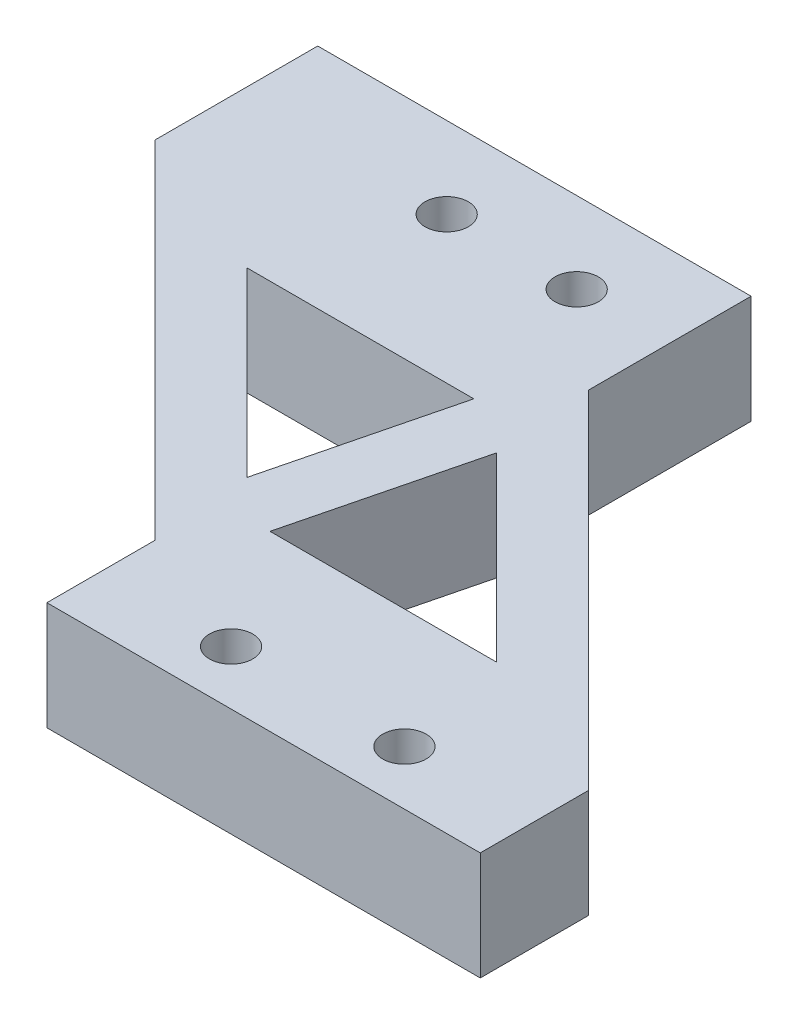
ISO-10303-21;
HEADER;
FILE_DESCRIPTION(('STEP AP214'),'2;1');
FILE_NAME('part.step','',(''),(''),'','','');
FILE_SCHEMA(('AUTOMOTIVE_DESIGN { 1 0 10303 214 1 1 1 1 }'));
ENDSEC;
DATA;
#1=APPLICATION_CONTEXT('core data for automotive mechanical design processes');
#2=APPLICATION_PROTOCOL_DEFINITION('international standard','automotive_design',2000,#1);
#3=PRODUCT_CONTEXT('',#1,'mechanical');
#4=PRODUCT('Part','Part','',(#3));
#5=PRODUCT_RELATED_PRODUCT_CATEGORY('part','',(#4));
#6=PRODUCT_DEFINITION_FORMATION('','',#4);
#7=PRODUCT_DEFINITION_CONTEXT('part definition',#1,'design');
#8=PRODUCT_DEFINITION('design','',#6,#7);
#9=PRODUCT_DEFINITION_SHAPE('','',#8);
#10=(LENGTH_UNIT() NAMED_UNIT(*) SI_UNIT(.MILLI.,.METRE.));
#11=(NAMED_UNIT(*) PLANE_ANGLE_UNIT() SI_UNIT($,.RADIAN.));
#12=(NAMED_UNIT(*) SI_UNIT($,.STERADIAN.) SOLID_ANGLE_UNIT());
#13=UNCERTAINTY_MEASURE_WITH_UNIT(LENGTH_MEASURE(1.E-05),#10,'distance_accuracy_value','');
#14=(GEOMETRIC_REPRESENTATION_CONTEXT(3) GLOBAL_UNCERTAINTY_ASSIGNED_CONTEXT((#13)) GLOBAL_UNIT_ASSIGNED_CONTEXT((#10,
#11,#12)) REPRESENTATION_CONTEXT('',''));
#15=CARTESIAN_POINT('',(0.,0.,0.));
#16=DIRECTION('',(0.,0.,1.));
#17=DIRECTION('',(1.,0.,0.));
#18=AXIS2_PLACEMENT_3D('',#15,#16,#17);
#19=CARTESIAN_POINT('',(-37.1727452841395,5.,-27.4746050582321));
#20=DIRECTION('',(0.707106781186549,0.,-0.707106781186546));
#21=DIRECTION('',(-0.707106781186546,0.,-0.707106781186549));
#22=AXIS2_PLACEMENT_3D('',#19,#20,#21);
#23=PLANE('',#22);
#24=DIRECTION('',(0.707106781186546,0.,0.707106781186549));
#25=VECTOR('',#24,1.);
#26=CARTESIAN_POINT('',(-37.1727452841395,0.,-27.4746050582321));
#27=LINE('',#26,#25);
#28=CARTESIAN_POINT('',(-37.1727452841395,0.,-27.4746050582321));
#29=VERTEX_POINT('',#28);
#30=CARTESIAN_POINT('',(-21.1727452841395,0.,-11.4746050582321));
#31=VERTEX_POINT('',#30);
#32=EDGE_CURVE('E226',#29,#31,#27,.T.);
#33=ORIENTED_EDGE('',*,*,#32,.T.);
#34=DIRECTION('',(0.,-1.,0.));
#35=VECTOR('',#34,1.);
#36=CARTESIAN_POINT('',(-21.1727452841395,5.,-11.4746050582321));
#37=LINE('',#36,#35);
#38=CARTESIAN_POINT('',(-21.1727452841395,5.,-11.4746050582321));
#39=VERTEX_POINT('',#38);
#40=EDGE_CURVE('E11',#39,#31,#37,.T.);
#41=ORIENTED_EDGE('',*,*,#40,.F.);
#42=DIRECTION('',(0.707106781186546,0.,0.707106781186549));
#43=VECTOR('',#42,1.);
#44=CARTESIAN_POINT('',(-37.1727452841395,5.,-27.4746050582321));
#45=LINE('',#44,#43);
#46=CARTESIAN_POINT('',(-37.1727452841395,5.,-27.4746050582321));
#47=VERTEX_POINT('',#46);
#48=EDGE_CURVE('E227',#47,#39,#45,.T.);
#49=ORIENTED_EDGE('',*,*,#48,.F.);
#50=DIRECTION('',(0.,-1.,0.));
#51=VECTOR('',#50,1.);
#52=CARTESIAN_POINT('',(-37.1727452841395,5.,-27.4746050582321));
#53=LINE('',#52,#51);
#54=EDGE_CURVE('E232',#47,#29,#53,.T.);
#55=ORIENTED_EDGE('',*,*,#54,.T.);
#56=EDGE_LOOP('',(#33,#41,#49,#55));
#57=FACE_BOUND('',#56,.T.);
#58=ADVANCED_FACE('F32',(#57),#23,.F.);
#59=CARTESIAN_POINT('',(-17.1727452841395,5.,-27.4746050582321));
#60=DIRECTION('',(-0.707106781186549,0.,0.707106781186546));
#61=DIRECTION('',(0.707106781186546,0.,0.707106781186549));
#62=AXIS2_PLACEMENT_3D('',#59,#60,#61);
#63=PLANE('',#62);
#64=DIRECTION('',(-0.707106781186546,0.,-0.707106781186549));
#65=VECTOR('',#64,1.);
#66=CARTESIAN_POINT('',(-17.1727452841395,0.,-27.4746050582321));
#67=LINE('',#66,#65);
#68=CARTESIAN_POINT('',(-1.17274528413952,0.,-11.4746050582321));
#69=VERTEX_POINT('',#68);
#70=CARTESIAN_POINT('',(-17.1727452841395,0.,-27.4746050582321));
#71=VERTEX_POINT('',#70);
#72=EDGE_CURVE('E230',#69,#71,#67,.T.);
#73=ORIENTED_EDGE('',*,*,#72,.T.);
#74=DIRECTION('',(0.,-1.,0.));
#75=VECTOR('',#74,1.);
#76=CARTESIAN_POINT('',(-17.1727452841395,5.,-27.4746050582321));
#77=LINE('',#76,#75);
#78=CARTESIAN_POINT('',(-17.1727452841395,5.,-27.4746050582321));
#79=VERTEX_POINT('',#78);
#80=EDGE_CURVE('E236',#79,#71,#77,.T.);
#81=ORIENTED_EDGE('',*,*,#80,.F.);
#82=DIRECTION('',(-0.707106781186546,0.,-0.707106781186549));
#83=VECTOR('',#82,1.);
#84=CARTESIAN_POINT('',(-17.1727452841395,5.,-27.4746050582321));
#85=LINE('',#84,#83);
#86=CARTESIAN_POINT('',(-1.17274528413952,5.,-11.4746050582321));
#87=VERTEX_POINT('',#86);
#88=EDGE_CURVE('E229',#87,#79,#85,.T.);
#89=ORIENTED_EDGE('',*,*,#88,.F.);
#90=DIRECTION('',(0.,-1.,0.));
#91=VECTOR('',#90,1.);
#92=CARTESIAN_POINT('',(-1.17274528413952,5.,-11.4746050582321));
#93=LINE('',#92,#91);
#94=EDGE_CURVE('E39',#87,#69,#93,.T.);
#95=ORIENTED_EDGE('',*,*,#94,.T.);
#96=EDGE_LOOP('',(#73,#81,#89,#95));
#97=FACE_BOUND('',#96,.T.);
#98=ADVANCED_FACE('F241',(#97),#63,.F.);
#99=CARTESIAN_POINT('',(0.,5.,0.));
#100=DIRECTION('',(0.,1.,0.));
#101=DIRECTION('',(0.,0.,1.));
#102=AXIS2_PLACEMENT_3D('',#99,#100,#101);
#103=PLANE('',#102);
#104=CARTESIAN_POINT('',(-27.4727452841395,5.,-31.2246050582321));
#105=DIRECTION('',(0.,1.,0.));
#106=DIRECTION('',(0.,0.,1.));
#107=AXIS2_PLACEMENT_3D('',#104,#105,#106);
#108=CIRCLE('',#107,1.);
#109=CARTESIAN_POINT('',(-27.4727452841395,5.,-30.2246050582321));
#110=VERTEX_POINT('',#109);
#111=EDGE_CURVE('E447',#110,#110,#108,.T.);
#112=ORIENTED_EDGE('',*,*,#111,.F.);
#113=EDGE_LOOP('',(#112));
#114=FACE_BOUND('',#113,.T.);
#115=CARTESIAN_POINT('',(-21.4727452841395,5.,-31.2246050582321));
#116=DIRECTION('',(0.,1.,0.));
#117=DIRECTION('',(0.,0.,1.));
#118=AXIS2_PLACEMENT_3D('',#115,#116,#117);
#119=CIRCLE('',#118,1.);
#120=CARTESIAN_POINT('',(-21.4727452841395,5.,-30.2246050582321));
#121=VERTEX_POINT('',#120);
#122=EDGE_CURVE('E451',#121,#121,#119,.T.);
#123=ORIENTED_EDGE('',*,*,#122,.F.);
#124=EDGE_LOOP('',(#123));
#125=FACE_BOUND('',#124,.T.);
#126=CARTESIAN_POINT('',(-7.17274528413953,5.,-8.97460505823207));
#127=DIRECTION('',(0.,1.,0.));
#128=DIRECTION('',(0.,0.,1.));
#129=AXIS2_PLACEMENT_3D('',#126,#127,#128);
#130=CIRCLE('',#129,1.);
#131=CARTESIAN_POINT('',(-7.17274528413953,5.,-7.97460505823207));
#132=VERTEX_POINT('',#131);
#133=EDGE_CURVE('E460',#132,#132,#130,.T.);
#134=ORIENTED_EDGE('',*,*,#133,.F.);
#135=EDGE_LOOP('',(#134));
#136=FACE_BOUND('',#135,.T.);
#137=CARTESIAN_POINT('',(-15.1727452841395,5.,-8.97460505823207));
#138=DIRECTION('',(0.,1.,0.));
#139=DIRECTION('',(0.,0.,1.));
#140=AXIS2_PLACEMENT_3D('',#137,#138,#139);
#141=CIRCLE('',#140,0.999999999999999);
#142=CARTESIAN_POINT('',(-15.1727452841395,5.,-7.97460505823207));
#143=VERTEX_POINT('',#142);
#144=EDGE_CURVE('E466',#143,#143,#141,.T.);
#145=ORIENTED_EDGE('',*,*,#144,.F.);
#146=EDGE_LOOP('',(#145));
#147=FACE_BOUND('',#146,.T.);
#148=DIRECTION('',(0.242535625036336,0.,-0.970142500145331));
#149=VECTOR('',#148,1.);
#150=CARTESIAN_POINT('',(-21.5611488344009,5.,-16.1056492956128));
#151=LINE('',#150,#149);
#152=CARTESIAN_POINT('',(-21.5611488344009,5.,-16.1056492956128));
#153=VERTEX_POINT('',#152);
#154=CARTESIAN_POINT('',(-19.4689098937461,5.,-24.4746050582321));
#155=VERTEX_POINT('',#154);
#156=EDGE_CURVE('E46',#153,#155,#151,.T.);
#157=ORIENTED_EDGE('',*,*,#156,.F.);
#158=DIRECTION('',(0.707106781186548,0.,0.707106781186547));
#159=VECTOR('',#158,1.);
#160=CARTESIAN_POINT('',(-21.5611488344009,5.,-16.1056492956128));
#161=LINE('',#160,#159);
#162=CARTESIAN_POINT('',(-29.9301045970202,5.,-24.4746050582321));
#163=VERTEX_POINT('',#162);
#164=EDGE_CURVE('E139',#163,#153,#161,.T.);
#165=ORIENTED_EDGE('',*,*,#164,.F.);
#166=DIRECTION('',(-1.,0.,0.));
#167=VECTOR('',#166,1.);
#168=CARTESIAN_POINT('',(-29.9301045970202,5.,-24.4746050582321));
#169=LINE('',#168,#167);
#170=EDGE_CURVE('E151',#155,#163,#169,.T.);
#171=ORIENTED_EDGE('',*,*,#170,.F.);
#172=EDGE_LOOP('',(#157,#165,#171));
#173=FACE_BOUND('',#172,.T.);
#174=DIRECTION('',(-0.242535625036336,0.,0.970142500145331));
#175=VECTOR('',#174,1.);
#176=CARTESIAN_POINT('',(-16.784341733878,5.,-22.8435608208513));
#177=LINE('',#176,#175);
#178=CARTESIAN_POINT('',(-16.784341733878,5.,-22.8435608208513));
#179=VERTEX_POINT('',#178);
#180=CARTESIAN_POINT('',(-18.8765806745329,5.,-14.4746050582321));
#181=VERTEX_POINT('',#180);
#182=EDGE_CURVE('E166',#179,#181,#177,.T.);
#183=ORIENTED_EDGE('',*,*,#182,.F.);
#184=DIRECTION('',(-0.707106781186548,0.,-0.707106781186547));
#185=VECTOR('',#184,1.);
#186=CARTESIAN_POINT('',(-16.784341733878,5.,-22.8435608208513));
#187=LINE('',#186,#185);
#188=CARTESIAN_POINT('',(-8.41538597125881,5.,-14.4746050582321));
#189=VERTEX_POINT('',#188);
#190=EDGE_CURVE('E171',#189,#179,#187,.T.);
#191=ORIENTED_EDGE('',*,*,#190,.F.);
#192=DIRECTION('',(1.,0.,0.));
#193=VECTOR('',#192,1.);
#194=CARTESIAN_POINT('',(-8.41538597125881,5.,-14.4746050582321));
#195=LINE('',#194,#193);
#196=EDGE_CURVE('E168',#181,#189,#195,.T.);
#197=ORIENTED_EDGE('',*,*,#196,.F.);
#198=EDGE_LOOP('',(#183,#191,#197));
#199=FACE_BOUND('',#198,.T.);
#200=ORIENTED_EDGE('',*,*,#48,.T.);
#201=DIRECTION('',(0.,0.,-1.));
#202=VECTOR('',#201,1.);
#203=CARTESIAN_POINT('',(-21.1727452841395,5.,-6.47460505823207));
#204=LINE('',#203,#202);
#205=CARTESIAN_POINT('',(-21.1727452841395,5.,-6.47460505823207));
#206=VERTEX_POINT('',#205);
#207=EDGE_CURVE('E193',#206,#39,#204,.T.);
#208=ORIENTED_EDGE('',*,*,#207,.F.);
#209=DIRECTION('',(-1.,0.,0.));
#210=VECTOR('',#209,1.);
#211=CARTESIAN_POINT('',(-21.1727452841395,5.,-6.47460505823207));
#212=LINE('',#211,#210);
#213=CARTESIAN_POINT('',(-1.17274528413952,5.,-6.47460505823207));
#214=VERTEX_POINT('',#213);
#215=EDGE_CURVE('E191',#214,#206,#212,.T.);
#216=ORIENTED_EDGE('',*,*,#215,.F.);
#217=DIRECTION('',(0.,0.,-1.));
#218=VECTOR('',#217,1.);
#219=CARTESIAN_POINT('',(-1.17274528413952,5.,-6.47460505823207));
#220=LINE('',#219,#218);
#221=EDGE_CURVE('E196',#214,#87,#220,.T.);
#222=ORIENTED_EDGE('',*,*,#221,.T.);
#223=ORIENTED_EDGE('',*,*,#88,.T.);
#224=DIRECTION('',(0.,0.,1.));
#225=VECTOR('',#224,1.);
#226=CARTESIAN_POINT('',(-17.1727452841395,5.,-34.9746050582321));
#227=LINE('',#226,#225);
#228=CARTESIAN_POINT('',(-17.1727452841395,5.,-34.9746050582321));
#229=VERTEX_POINT('',#228);
#230=EDGE_CURVE('E220',#229,#79,#227,.T.);
#231=ORIENTED_EDGE('',*,*,#230,.F.);
#232=DIRECTION('',(1.,0.,0.));
#233=VECTOR('',#232,1.);
#234=CARTESIAN_POINT('',(-37.1727452841395,5.,-34.9746050582321));
#235=LINE('',#234,#233);
#236=CARTESIAN_POINT('',(-37.1727452841395,5.,-34.9746050582321));
#237=VERTEX_POINT('',#236);
#238=EDGE_CURVE('E208',#237,#229,#235,.T.);
#239=ORIENTED_EDGE('',*,*,#238,.F.);
#240=DIRECTION('',(0.,0.,1.));
#241=VECTOR('',#240,1.);
#242=CARTESIAN_POINT('',(-37.1727452841395,5.,-34.9746050582321));
#243=LINE('',#242,#241);
#244=EDGE_CURVE('E223',#237,#47,#243,.T.);
#245=ORIENTED_EDGE('',*,*,#244,.T.);
#246=EDGE_LOOP('',(#200,#208,#216,#222,#223,#231,#239,#245));
#247=FACE_BOUND('',#246,.T.);
#248=ADVANCED_FACE('F275',(#114,#125,#136,#147,#173,#199,#247),#103,.T.);
#249=CARTESIAN_POINT('',(0.,0.,0.));
#250=DIRECTION('',(0.,1.,0.));
#251=DIRECTION('',(0.,0.,1.));
#252=AXIS2_PLACEMENT_3D('',#249,#250,#251);
#253=PLANE('',#252);
#254=CARTESIAN_POINT('',(-27.4727452841395,0.,-31.2246050582321));
#255=DIRECTION('',(0.,1.,0.));
#256=DIRECTION('',(0.,0.,1.));
#257=AXIS2_PLACEMENT_3D('',#254,#255,#256);
#258=CIRCLE('',#257,1.);
#259=CARTESIAN_POINT('',(-27.4727452841395,0.,-30.2246050582321));
#260=VERTEX_POINT('',#259);
#261=EDGE_CURVE('E450',#260,#260,#258,.F.);
#262=ORIENTED_EDGE('',*,*,#261,.F.);
#263=EDGE_LOOP('',(#262));
#264=FACE_BOUND('',#263,.T.);
#265=CARTESIAN_POINT('',(-21.4727452841395,0.,-31.2246050582321));
#266=DIRECTION('',(0.,1.,0.));
#267=DIRECTION('',(0.,0.,1.));
#268=AXIS2_PLACEMENT_3D('',#265,#266,#267);
#269=CIRCLE('',#268,1.);
#270=CARTESIAN_POINT('',(-21.4727452841395,0.,-30.2246050582321));
#271=VERTEX_POINT('',#270);
#272=EDGE_CURVE('E454',#271,#271,#269,.F.);
#273=ORIENTED_EDGE('',*,*,#272,.F.);
#274=EDGE_LOOP('',(#273));
#275=FACE_BOUND('',#274,.T.);
#276=CARTESIAN_POINT('',(-7.17274528413953,0.,-8.97460505823207));
#277=DIRECTION('',(0.,1.,0.));
#278=DIRECTION('',(0.,0.,1.));
#279=AXIS2_PLACEMENT_3D('',#276,#277,#278);
#280=CIRCLE('',#279,1.);
#281=CARTESIAN_POINT('',(-7.17274528413953,0.,-7.97460505823207));
#282=VERTEX_POINT('',#281);
#283=EDGE_CURVE('E463',#282,#282,#280,.F.);
#284=ORIENTED_EDGE('',*,*,#283,.F.);
#285=EDGE_LOOP('',(#284));
#286=FACE_BOUND('',#285,.T.);
#287=CARTESIAN_POINT('',(-15.1727452841395,0.,-8.97460505823207));
#288=DIRECTION('',(0.,1.,0.));
#289=DIRECTION('',(0.,0.,1.));
#290=AXIS2_PLACEMENT_3D('',#287,#288,#289);
#291=CIRCLE('',#290,0.999999999999999);
#292=CARTESIAN_POINT('',(-15.1727452841395,0.,-7.97460505823207));
#293=VERTEX_POINT('',#292);
#294=EDGE_CURVE('E153',#293,#293,#291,.F.);
#295=ORIENTED_EDGE('',*,*,#294,.F.);
#296=EDGE_LOOP('',(#295));
#297=FACE_BOUND('',#296,.T.);
#298=DIRECTION('',(-0.707106781186548,0.,-0.707106781186547));
#299=VECTOR('',#298,1.);
#300=CARTESIAN_POINT('',(-21.5611488344009,0.,-16.1056492956128));
#301=LINE('',#300,#299);
#302=CARTESIAN_POINT('',(-21.5611488344009,0.,-16.1056492956128));
#303=VERTEX_POINT('',#302);
#304=CARTESIAN_POINT('',(-29.9301045970202,0.,-24.4746050582321));
#305=VERTEX_POINT('',#304);
#306=EDGE_CURVE('E54',#303,#305,#301,.T.);
#307=ORIENTED_EDGE('',*,*,#306,.F.);
#308=DIRECTION('',(-0.242535625036336,0.,0.970142500145331));
#309=VECTOR('',#308,1.);
#310=CARTESIAN_POINT('',(-21.5611488344009,0.,-16.1056492956128));
#311=LINE('',#310,#309);
#312=CARTESIAN_POINT('',(-19.4689098937461,0.,-24.4746050582321));
#313=VERTEX_POINT('',#312);
#314=EDGE_CURVE('E134',#313,#303,#311,.T.);
#315=ORIENTED_EDGE('',*,*,#314,.F.);
#316=DIRECTION('',(1.,0.,0.));
#317=VECTOR('',#316,1.);
#318=CARTESIAN_POINT('',(-29.9301045970202,0.,-24.4746050582321));
#319=LINE('',#318,#317);
#320=EDGE_CURVE('E142',#305,#313,#319,.T.);
#321=ORIENTED_EDGE('',*,*,#320,.F.);
#322=EDGE_LOOP('',(#307,#315,#321));
#323=FACE_BOUND('',#322,.T.);
#324=DIRECTION('',(0.707106781186548,0.,0.707106781186547));
#325=VECTOR('',#324,1.);
#326=CARTESIAN_POINT('',(-16.784341733878,0.,-22.8435608208513));
#327=LINE('',#326,#325);
#328=CARTESIAN_POINT('',(-16.784341733878,0.,-22.8435608208513));
#329=VERTEX_POINT('',#328);
#330=CARTESIAN_POINT('',(-8.41538597125881,0.,-14.4746050582321));
#331=VERTEX_POINT('',#330);
#332=EDGE_CURVE('E145',#329,#331,#327,.T.);
#333=ORIENTED_EDGE('',*,*,#332,.F.);
#334=DIRECTION('',(0.242535625036336,0.,-0.970142500145331));
#335=VECTOR('',#334,1.);
#336=CARTESIAN_POINT('',(-16.784341733878,0.,-22.8435608208513));
#337=LINE('',#336,#335);
#338=CARTESIAN_POINT('',(-18.8765806745329,0.,-14.4746050582321));
#339=VERTEX_POINT('',#338);
#340=EDGE_CURVE('E163',#339,#329,#337,.T.);
#341=ORIENTED_EDGE('',*,*,#340,.F.);
#342=DIRECTION('',(-1.,0.,0.));
#343=VECTOR('',#342,1.);
#344=CARTESIAN_POINT('',(-8.41538597125881,0.,-14.4746050582321));
#345=LINE('',#344,#343);
#346=EDGE_CURVE('E177',#331,#339,#345,.T.);
#347=ORIENTED_EDGE('',*,*,#346,.F.);
#348=EDGE_LOOP('',(#333,#341,#347));
#349=FACE_BOUND('',#348,.T.);
#350=ORIENTED_EDGE('',*,*,#32,.F.);
#351=DIRECTION('',(0.,0.,1.));
#352=VECTOR('',#351,1.);
#353=CARTESIAN_POINT('',(-37.1727452841395,0.,-34.9746050582321));
#354=LINE('',#353,#352);
#355=CARTESIAN_POINT('',(-37.1727452841395,0.,-34.9746050582321));
#356=VERTEX_POINT('',#355);
#357=EDGE_CURVE('E214',#356,#29,#354,.T.);
#358=ORIENTED_EDGE('',*,*,#357,.F.);
#359=DIRECTION('',(-1.,0.,0.));
#360=VECTOR('',#359,1.);
#361=CARTESIAN_POINT('',(-37.1727452841395,0.,-34.9746050582321));
#362=LINE('',#361,#360);
#363=CARTESIAN_POINT('',(-17.1727452841395,0.,-34.9746050582321));
#364=VERTEX_POINT('',#363);
#365=EDGE_CURVE('E212',#364,#356,#362,.T.);
#366=ORIENTED_EDGE('',*,*,#365,.F.);
#367=DIRECTION('',(0.,0.,1.));
#368=VECTOR('',#367,1.);
#369=CARTESIAN_POINT('',(-17.1727452841395,0.,-34.9746050582321));
#370=LINE('',#369,#368);
#371=EDGE_CURVE('E217',#364,#71,#370,.T.);
#372=ORIENTED_EDGE('',*,*,#371,.T.);
#373=ORIENTED_EDGE('',*,*,#72,.F.);
#374=DIRECTION('',(0.,0.,-1.));
#375=VECTOR('',#374,1.);
#376=CARTESIAN_POINT('',(-1.17274528413952,0.,-6.47460505823207));
#377=LINE('',#376,#375);
#378=CARTESIAN_POINT('',(-1.17274528413952,0.,-6.47460505823207));
#379=VERTEX_POINT('',#378);
#380=EDGE_CURVE('E199',#379,#69,#377,.T.);
#381=ORIENTED_EDGE('',*,*,#380,.F.);
#382=DIRECTION('',(1.,0.,0.));
#383=VECTOR('',#382,1.);
#384=CARTESIAN_POINT('',(-21.1727452841395,0.,-6.47460505823207));
#385=LINE('',#384,#383);
#386=CARTESIAN_POINT('',(-21.1727452841395,0.,-6.47460505823207));
#387=VERTEX_POINT('',#386);
#388=EDGE_CURVE('E187',#387,#379,#385,.T.);
#389=ORIENTED_EDGE('',*,*,#388,.F.);
#390=DIRECTION('',(0.,0.,-1.));
#391=VECTOR('',#390,1.);
#392=CARTESIAN_POINT('',(-21.1727452841395,0.,-6.47460505823207));
#393=LINE('',#392,#391);
#394=EDGE_CURVE('E202',#387,#31,#393,.T.);
#395=ORIENTED_EDGE('',*,*,#394,.T.);
#396=EDGE_LOOP('',(#350,#358,#366,#372,#373,#381,#389,#395));
#397=FACE_BOUND('',#396,.T.);
#398=ADVANCED_FACE('F148',(#264,#275,#286,#297,#323,#349,#397),#253,.F.);
#399=CARTESIAN_POINT('',(-37.1727452841395,0.,-34.9746050582321));
#400=DIRECTION('',(1.,0.,0.));
#401=DIRECTION('',(0.,0.,-1.));
#402=AXIS2_PLACEMENT_3D('',#399,#400,#401);
#403=PLANE('',#402);
#404=ORIENTED_EDGE('',*,*,#54,.F.);
#405=ORIENTED_EDGE('',*,*,#244,.F.);
#406=DIRECTION('',(0.,1.,0.));
#407=VECTOR('',#406,1.);
#408=CARTESIAN_POINT('',(-37.1727452841395,0.,-34.9746050582321));
#409=LINE('',#408,#407);
#410=EDGE_CURVE('E205',#356,#237,#409,.T.);
#411=ORIENTED_EDGE('',*,*,#410,.F.);
#412=ORIENTED_EDGE('',*,*,#357,.T.);
#413=EDGE_LOOP('',(#404,#405,#411,#412));
#414=FACE_BOUND('',#413,.T.);
#415=ADVANCED_FACE('F266',(#414),#403,.F.);
#416=CARTESIAN_POINT('',(-17.1727452841395,0.,-34.9746050582321));
#417=DIRECTION('',(-1.,0.,0.));
#418=DIRECTION('',(0.,0.,1.));
#419=AXIS2_PLACEMENT_3D('',#416,#417,#418);
#420=PLANE('',#419);
#421=ORIENTED_EDGE('',*,*,#80,.T.);
#422=ORIENTED_EDGE('',*,*,#371,.F.);
#423=DIRECTION('',(0.,-1.,0.));
#424=VECTOR('',#423,1.);
#425=CARTESIAN_POINT('',(-17.1727452841395,0.,-34.9746050582321));
#426=LINE('',#425,#424);
#427=EDGE_CURVE('E210',#229,#364,#426,.T.);
#428=ORIENTED_EDGE('',*,*,#427,.F.);
#429=ORIENTED_EDGE('',*,*,#230,.T.);
#430=EDGE_LOOP('',(#421,#422,#428,#429));
#431=FACE_BOUND('',#430,.T.);
#432=ADVANCED_FACE('F273',(#431),#420,.F.);
#433=CARTESIAN_POINT('',(0.,0.,-34.9746050582321));
#434=DIRECTION('',(0.,0.,-1.));
#435=DIRECTION('',(-1.,0.,0.));
#436=AXIS2_PLACEMENT_3D('',#433,#434,#435);
#437=PLANE('',#436);
#438=ORIENTED_EDGE('',*,*,#410,.T.);
#439=ORIENTED_EDGE('',*,*,#238,.T.);
#440=ORIENTED_EDGE('',*,*,#427,.T.);
#441=ORIENTED_EDGE('',*,*,#365,.T.);
#442=EDGE_LOOP('',(#438,#439,#440,#441));
#443=FACE_BOUND('',#442,.T.);
#444=ADVANCED_FACE('F269',(#443),#437,.T.);
#445=CARTESIAN_POINT('',(-21.1727452841395,5.,-6.47460505823207));
#446=DIRECTION('',(1.,0.,0.));
#447=DIRECTION('',(0.,0.,-1.));
#448=AXIS2_PLACEMENT_3D('',#445,#446,#447);
#449=PLANE('',#448);
#450=ORIENTED_EDGE('',*,*,#40,.T.);
#451=ORIENTED_EDGE('',*,*,#394,.F.);
#452=DIRECTION('',(0.,-1.,0.));
#453=VECTOR('',#452,1.);
#454=CARTESIAN_POINT('',(-21.1727452841395,5.,-6.47460505823207));
#455=LINE('',#454,#453);
#456=EDGE_CURVE('E184',#206,#387,#455,.T.);
#457=ORIENTED_EDGE('',*,*,#456,.F.);
#458=ORIENTED_EDGE('',*,*,#207,.T.);
#459=EDGE_LOOP('',(#450,#451,#457,#458));
#460=FACE_BOUND('',#459,.T.);
#461=ADVANCED_FACE('F261',(#460),#449,.F.);
#462=CARTESIAN_POINT('',(-1.17274528413952,5.,-6.47460505823207));
#463=DIRECTION('',(-1.,0.,0.));
#464=DIRECTION('',(0.,-1.,0.));
#465=AXIS2_PLACEMENT_3D('',#462,#463,#464);
#466=PLANE('',#465);
#467=ORIENTED_EDGE('',*,*,#94,.F.);
#468=ORIENTED_EDGE('',*,*,#221,.F.);
#469=DIRECTION('',(0.,1.,0.));
#470=VECTOR('',#469,1.);
#471=CARTESIAN_POINT('',(-1.17274528413952,5.,-6.47460505823207));
#472=LINE('',#471,#470);
#473=EDGE_CURVE('E189',#379,#214,#472,.T.);
#474=ORIENTED_EDGE('',*,*,#473,.F.);
#475=ORIENTED_EDGE('',*,*,#380,.T.);
#476=EDGE_LOOP('',(#467,#468,#474,#475));
#477=FACE_BOUND('',#476,.T.);
#478=ADVANCED_FACE('F251',(#477),#466,.F.);
#479=CARTESIAN_POINT('',(0.,0.,-6.47460505823207));
#480=DIRECTION('',(0.,0.,1.));
#481=DIRECTION('',(1.,0.,0.));
#482=AXIS2_PLACEMENT_3D('',#479,#480,#481);
#483=PLANE('',#482);
#484=ORIENTED_EDGE('',*,*,#456,.T.);
#485=ORIENTED_EDGE('',*,*,#388,.T.);
#486=ORIENTED_EDGE('',*,*,#473,.T.);
#487=ORIENTED_EDGE('',*,*,#215,.T.);
#488=EDGE_LOOP('',(#484,#485,#486,#487));
#489=FACE_BOUND('',#488,.T.);
#490=ADVANCED_FACE('F254',(#489),#483,.T.);
#491=CARTESIAN_POINT('',(-16.784341733878,-0.00100000000000013,-22.8435608208513));
#492=DIRECTION('',(-0.970142500145331,0.,-0.242535625036336));
#493=DIRECTION('',(-0.242535625036336,0.,0.970142500145331));
#494=AXIS2_PLACEMENT_3D('',#491,#492,#493);
#495=PLANE('',#494);
#496=ORIENTED_EDGE('',*,*,#340,.T.);
#497=DIRECTION('',(0.,1.,0.));
#498=VECTOR('',#497,1.);
#499=CARTESIAN_POINT('',(-16.784341733878,-0.00100000000000013,-22.8435608208513));
#500=LINE('',#499,#498);
#501=EDGE_CURVE('E175',#329,#179,#500,.T.);
#502=ORIENTED_EDGE('',*,*,#501,.T.);
#503=ORIENTED_EDGE('',*,*,#182,.T.);
#504=DIRECTION('',(0.,1.,0.));
#505=VECTOR('',#504,1.);
#506=CARTESIAN_POINT('',(-18.8765806745329,-0.00100000000000013,-14.4746050582321));
#507=LINE('',#506,#505);
#508=EDGE_CURVE('E174',#339,#181,#507,.T.);
#509=ORIENTED_EDGE('',*,*,#508,.F.);
#510=EDGE_LOOP('',(#496,#502,#503,#509));
#511=FACE_BOUND('',#510,.T.);
#512=ADVANCED_FACE('F344',(#511),#495,.F.);
#513=CARTESIAN_POINT('',(-16.784341733878,-0.00100000000000013,-22.8435608208513));
#514=DIRECTION('',(0.707106781186548,0.,-0.707106781186548));
#515=DIRECTION('',(-0.707106781186548,0.,-0.707106781186547));
#516=AXIS2_PLACEMENT_3D('',#513,#514,#515);
#517=PLANE('',#516);
#518=ORIENTED_EDGE('',*,*,#332,.T.);
#519=DIRECTION('',(0.,1.,0.));
#520=VECTOR('',#519,1.);
#521=CARTESIAN_POINT('',(-8.41538597125881,-0.00100000000000013,-14.4746050582321));
#522=LINE('',#521,#520);
#523=EDGE_CURVE('E178',#331,#189,#522,.T.);
#524=ORIENTED_EDGE('',*,*,#523,.T.);
#525=ORIENTED_EDGE('',*,*,#190,.T.);
#526=ORIENTED_EDGE('',*,*,#501,.F.);
#527=EDGE_LOOP('',(#518,#524,#525,#526));
#528=FACE_BOUND('',#527,.T.);
#529=ADVANCED_FACE('F351',(#528),#517,.F.);
#530=CARTESIAN_POINT('',(-8.41538597125881,-0.00100000000000013,-14.4746050582321));
#531=DIRECTION('',(0.,0.,1.));
#532=DIRECTION('',(1.,0.,0.));
#533=AXIS2_PLACEMENT_3D('',#530,#531,#532);
#534=PLANE('',#533);
#535=ORIENTED_EDGE('',*,*,#346,.T.);
#536=ORIENTED_EDGE('',*,*,#508,.T.);
#537=ORIENTED_EDGE('',*,*,#196,.T.);
#538=ORIENTED_EDGE('',*,*,#523,.F.);
#539=EDGE_LOOP('',(#535,#536,#537,#538));
#540=FACE_BOUND('',#539,.T.);
#541=ADVANCED_FACE('F359',(#540),#534,.F.);
#542=CARTESIAN_POINT('',(-21.5611488344009,-0.00100000000000013,-16.1056492956128));
#543=DIRECTION('',(0.970142500145331,0.,0.242535625036336));
#544=DIRECTION('',(0.242535625036336,0.,-0.970142500145331));
#545=AXIS2_PLACEMENT_3D('',#542,#543,#544);
#546=PLANE('',#545);
#547=ORIENTED_EDGE('',*,*,#314,.T.);
#548=DIRECTION('',(0.,1.,0.));
#549=VECTOR('',#548,1.);
#550=CARTESIAN_POINT('',(-21.5611488344009,-0.00100000000000013,-16.1056492956128));
#551=LINE('',#550,#549);
#552=EDGE_CURVE('E146',#303,#153,#551,.T.);
#553=ORIENTED_EDGE('',*,*,#552,.T.);
#554=ORIENTED_EDGE('',*,*,#156,.T.);
#555=DIRECTION('',(0.,1.,0.));
#556=VECTOR('',#555,1.);
#557=CARTESIAN_POINT('',(-19.4689098937461,-0.00100000000000013,-24.4746050582321));
#558=LINE('',#557,#556);
#559=EDGE_CURVE('E130',#313,#155,#558,.T.);
#560=ORIENTED_EDGE('',*,*,#559,.F.);
#561=EDGE_LOOP('',(#547,#553,#554,#560));
#562=FACE_BOUND('',#561,.T.);
#563=ADVANCED_FACE('F132',(#562),#546,.F.);
#564=CARTESIAN_POINT('',(-21.5611488344009,-0.00100000000000013,-16.1056492956128));
#565=DIRECTION('',(-0.707106781186548,0.,0.707106781186548));
#566=DIRECTION('',(0.707106781186548,0.,0.707106781186547));
#567=AXIS2_PLACEMENT_3D('',#564,#565,#566);
#568=PLANE('',#567);
#569=ORIENTED_EDGE('',*,*,#306,.T.);
#570=DIRECTION('',(0.,1.,0.));
#571=VECTOR('',#570,1.);
#572=CARTESIAN_POINT('',(-29.9301045970202,-0.00100000000000013,-24.4746050582321));
#573=LINE('',#572,#571);
#574=EDGE_CURVE('E138',#305,#163,#573,.T.);
#575=ORIENTED_EDGE('',*,*,#574,.T.);
#576=ORIENTED_EDGE('',*,*,#164,.T.);
#577=ORIENTED_EDGE('',*,*,#552,.F.);
#578=EDGE_LOOP('',(#569,#575,#576,#577));
#579=FACE_BOUND('',#578,.T.);
#580=ADVANCED_FACE('F374',(#579),#568,.F.);
#581=CARTESIAN_POINT('',(-29.9301045970202,-0.00100000000000013,-24.4746050582321));
#582=DIRECTION('',(0.,0.,-1.));
#583=DIRECTION('',(-1.,0.,0.));
#584=AXIS2_PLACEMENT_3D('',#581,#582,#583);
#585=PLANE('',#584);
#586=ORIENTED_EDGE('',*,*,#320,.T.);
#587=ORIENTED_EDGE('',*,*,#559,.T.);
#588=ORIENTED_EDGE('',*,*,#170,.T.);
#589=ORIENTED_EDGE('',*,*,#574,.F.);
#590=EDGE_LOOP('',(#586,#587,#588,#589));
#591=FACE_BOUND('',#590,.T.);
#592=ADVANCED_FACE('F143',(#591),#585,.F.);
#593=CARTESIAN_POINT('',(-15.1727452841395,-0.00100000000000013,-8.97460505823207));
#594=DIRECTION('',(0.,1.,0.));
#595=DIRECTION('',(0.,0.,1.));
#596=AXIS2_PLACEMENT_3D('',#593,#594,#595);
#597=CYLINDRICAL_SURFACE('',#596,0.999999999999999);
#598=ORIENTED_EDGE('',*,*,#144,.T.);
#599=EDGE_LOOP('',(#598));
#600=FACE_BOUND('',#599,.T.);
#601=ORIENTED_EDGE('',*,*,#294,.T.);
#602=EDGE_LOOP('',(#601));
#603=FACE_BOUND('',#602,.T.);
#604=ADVANCED_FACE('F387',(#600,#603),#597,.F.);
#605=CARTESIAN_POINT('',(-7.17274528413953,-0.00100000000000013,-8.97460505823207));
#606=DIRECTION('',(0.,1.,0.));
#607=DIRECTION('',(0.,0.,1.));
#608=AXIS2_PLACEMENT_3D('',#605,#606,#607);
#609=CYLINDRICAL_SURFACE('',#608,1.);
#610=ORIENTED_EDGE('',*,*,#133,.T.);
#611=EDGE_LOOP('',(#610));
#612=FACE_BOUND('',#611,.T.);
#613=ORIENTED_EDGE('',*,*,#283,.T.);
#614=EDGE_LOOP('',(#613));
#615=FACE_BOUND('',#614,.T.);
#616=ADVANCED_FACE('F394',(#612,#615),#609,.F.);
#617=CARTESIAN_POINT('',(-21.4727452841395,-0.00100000000000013,-31.2246050582321));
#618=DIRECTION('',(0.,1.,0.));
#619=DIRECTION('',(0.,0.,1.));
#620=AXIS2_PLACEMENT_3D('',#617,#618,#619);
#621=CYLINDRICAL_SURFACE('',#620,1.);
#622=ORIENTED_EDGE('',*,*,#122,.T.);
#623=EDGE_LOOP('',(#622));
#624=FACE_BOUND('',#623,.T.);
#625=ORIENTED_EDGE('',*,*,#272,.T.);
#626=EDGE_LOOP('',(#625));
#627=FACE_BOUND('',#626,.T.);
#628=ADVANCED_FACE('F401',(#624,#627),#621,.F.);
#629=CARTESIAN_POINT('',(-27.4727452841395,-0.00100000000000013,-31.2246050582321));
#630=DIRECTION('',(0.,1.,0.));
#631=DIRECTION('',(0.,0.,1.));
#632=AXIS2_PLACEMENT_3D('',#629,#630,#631);
#633=CYLINDRICAL_SURFACE('',#632,1.);
#634=ORIENTED_EDGE('',*,*,#111,.T.);
#635=EDGE_LOOP('',(#634));
#636=FACE_BOUND('',#635,.T.);
#637=ORIENTED_EDGE('',*,*,#261,.T.);
#638=EDGE_LOOP('',(#637));
#639=FACE_BOUND('',#638,.T.);
#640=ADVANCED_FACE('F408',(#636,#639),#633,.F.);
#641=CLOSED_SHELL('',(#58,#98,#248,#398,#415,#432,#444,#461,#478,#490,#512,#529,#541,#563,#580,
#592,#604,#616,#628,#640));
#642=MANIFOLD_SOLID_BREP('B2',#641);
#643=ADVANCED_BREP_SHAPE_REPRESENTATION('',(#18,#642),#14);
#644=SHAPE_DEFINITION_REPRESENTATION(#9,#643);
ENDSEC;
END-ISO-10303-21;
